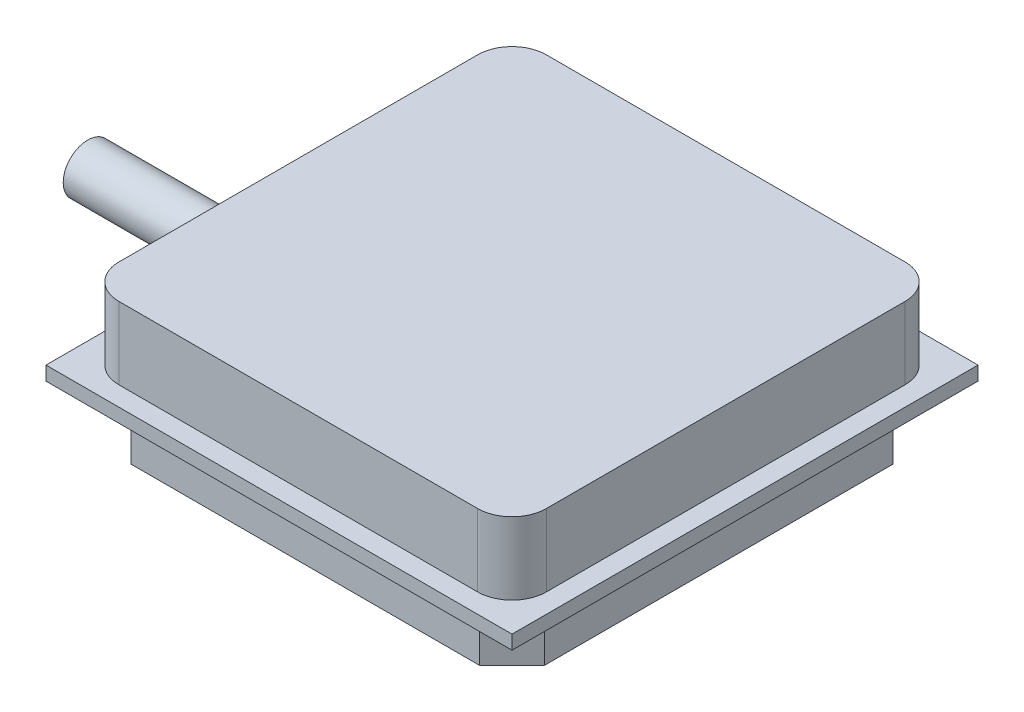
ISO-10303-21;
HEADER;
FILE_DESCRIPTION(('STEP AP214'),'2;1');
FILE_NAME('part.step','',(''),(''),'','','');
FILE_SCHEMA(('AUTOMOTIVE_DESIGN { 1 0 10303 214 1 1 1 1 }'));
ENDSEC;
DATA;
#1=APPLICATION_CONTEXT('core data for automotive mechanical design processes');
#2=APPLICATION_PROTOCOL_DEFINITION('international standard','automotive_design',2000,#1);
#3=PRODUCT_CONTEXT('',#1,'mechanical');
#4=PRODUCT('Part','Part','',(#3));
#5=PRODUCT_RELATED_PRODUCT_CATEGORY('part','',(#4));
#6=PRODUCT_DEFINITION_FORMATION('','',#4);
#7=PRODUCT_DEFINITION_CONTEXT('part definition',#1,'design');
#8=PRODUCT_DEFINITION('design','',#6,#7);
#9=PRODUCT_DEFINITION_SHAPE('','',#8);
#10=(LENGTH_UNIT() NAMED_UNIT(*) SI_UNIT(.MILLI.,.METRE.));
#11=(NAMED_UNIT(*) PLANE_ANGLE_UNIT() SI_UNIT($,.RADIAN.));
#12=(NAMED_UNIT(*) SI_UNIT($,.STERADIAN.) SOLID_ANGLE_UNIT());
#13=UNCERTAINTY_MEASURE_WITH_UNIT(LENGTH_MEASURE(1.E-05),#10,'distance_accuracy_value','');
#14=(GEOMETRIC_REPRESENTATION_CONTEXT(3) GLOBAL_UNCERTAINTY_ASSIGNED_CONTEXT((#13)) GLOBAL_UNIT_ASSIGNED_CONTEXT((#10,
#11,#12)) REPRESENTATION_CONTEXT('',''));
#15=CARTESIAN_POINT('',(0.,0.,0.));
#16=DIRECTION('',(0.,0.,1.));
#17=DIRECTION('',(1.,0.,0.));
#18=AXIS2_PLACEMENT_3D('',#15,#16,#17);
#19=CARTESIAN_POINT('',(0.,0.8128,0.));
#20=DIRECTION('',(0.,-1.,0.));
#21=DIRECTION('',(0.,0.,-1.));
#22=AXIS2_PLACEMENT_3D('',#19,#20,#21);
#23=PLANE('',#22);
#24=DIRECTION('',(0.,0.,1.));
#25=VECTOR('',#24,1.);
#26=CARTESIAN_POINT('',(0.,0.8128,0.));
#27=LINE('',#26,#25);
#28=CARTESIAN_POINT('',(0.,0.8128,-27.2034));
#29=VERTEX_POINT('',#28);
#30=CARTESIAN_POINT('',(0.,0.8128,0.));
#31=VERTEX_POINT('',#30);
#32=EDGE_CURVE('E280',#29,#31,#27,.T.);
#33=ORIENTED_EDGE('',*,*,#32,.T.);
#34=DIRECTION('',(1.,0.,0.));
#35=VECTOR('',#34,1.);
#36=CARTESIAN_POINT('',(0.,0.8128,0.));
#37=LINE('',#36,#35);
#38=CARTESIAN_POINT('',(27.2034,0.8128,0.));
#39=VERTEX_POINT('',#38);
#40=EDGE_CURVE('E283',#31,#39,#37,.T.);
#41=ORIENTED_EDGE('',*,*,#40,.T.);
#42=DIRECTION('',(0.,0.,-1.));
#43=VECTOR('',#42,1.);
#44=CARTESIAN_POINT('',(27.2034,0.8128,0.));
#45=LINE('',#44,#43);
#46=CARTESIAN_POINT('',(27.2034,0.8128,-27.2034));
#47=VERTEX_POINT('',#46);
#48=EDGE_CURVE('E286',#39,#47,#45,.T.);
#49=ORIENTED_EDGE('',*,*,#48,.T.);
#50=DIRECTION('',(-1.,0.,0.));
#51=VECTOR('',#50,1.);
#52=CARTESIAN_POINT('',(0.,0.8128,-27.2034));
#53=LINE('',#52,#51);
#54=EDGE_CURVE('E288',#47,#29,#53,.T.);
#55=ORIENTED_EDGE('',*,*,#54,.T.);
#56=EDGE_LOOP('',(#33,#41,#49,#55));
#57=FACE_BOUND('',#56,.T.);
#58=CARTESIAN_POINT('',(3.1303,0.8128,-3.1303));
#59=DIRECTION('',(0.,1.,0.));
#60=DIRECTION('',(0.,0.,1.));
#61=AXIS2_PLACEMENT_3D('',#58,#59,#60);
#62=CIRCLE('',#61,2.);
#63=CARTESIAN_POINT('',(1.1303,0.8128,-3.13030000000001));
#64=VERTEX_POINT('',#63);
#65=CARTESIAN_POINT('',(3.13030000000002,0.8128,-1.1303));
#66=VERTEX_POINT('',#65);
#67=EDGE_CURVE('E209',#64,#66,#62,.T.);
#68=ORIENTED_EDGE('',*,*,#67,.F.);
#69=DIRECTION('',(0.,0.,1.));
#70=VECTOR('',#69,1.);
#71=CARTESIAN_POINT('',(1.1303,0.8128,-24.0731));
#72=LINE('',#71,#70);
#73=CARTESIAN_POINT('',(1.1303,0.8128,-24.0731));
#74=VERTEX_POINT('',#73);
#75=EDGE_CURVE('E222',#74,#64,#72,.T.);
#76=ORIENTED_EDGE('',*,*,#75,.F.);
#77=CARTESIAN_POINT('',(3.1303,0.8128,-24.0731));
#78=DIRECTION('',(0.,1.,0.));
#79=DIRECTION('',(0.,0.,1.));
#80=AXIS2_PLACEMENT_3D('',#77,#78,#79);
#81=CIRCLE('',#80,2.);
#82=CARTESIAN_POINT('',(3.13030000000002,0.8128,-26.0731));
#83=VERTEX_POINT('',#82);
#84=EDGE_CURVE('E251',#83,#74,#81,.T.);
#85=ORIENTED_EDGE('',*,*,#84,.F.);
#86=DIRECTION('',(-1.,0.,0.));
#87=VECTOR('',#86,1.);
#88=CARTESIAN_POINT('',(3.13030000000002,0.8128,-26.0731));
#89=LINE('',#88,#87);
#90=CARTESIAN_POINT('',(24.0731,0.8128,-26.0731));
#91=VERTEX_POINT('',#90);
#92=EDGE_CURVE('E248',#91,#83,#89,.T.);
#93=ORIENTED_EDGE('',*,*,#92,.F.);
#94=CARTESIAN_POINT('',(24.0731,0.8128,-24.0731));
#95=DIRECTION('',(0.,1.,0.));
#96=DIRECTION('',(0.,0.,-1.));
#97=AXIS2_PLACEMENT_3D('',#94,#95,#96);
#98=CIRCLE('',#97,2.);
#99=CARTESIAN_POINT('',(26.0731,0.8128,-24.0731));
#100=VERTEX_POINT('',#99);
#101=EDGE_CURVE('E245',#100,#91,#98,.T.);
#102=ORIENTED_EDGE('',*,*,#101,.F.);
#103=DIRECTION('',(0.,0.,-1.));
#104=VECTOR('',#103,1.);
#105=CARTESIAN_POINT('',(26.0731,0.8128,-24.0731));
#106=LINE('',#105,#104);
#107=CARTESIAN_POINT('',(26.0731,0.8128,-3.13030000000001));
#108=VERTEX_POINT('',#107);
#109=EDGE_CURVE('E242',#108,#100,#106,.T.);
#110=ORIENTED_EDGE('',*,*,#109,.F.);
#111=CARTESIAN_POINT('',(24.0731,0.8128,-3.1303));
#112=DIRECTION('',(0.,1.,0.));
#113=DIRECTION('',(0.,0.,1.));
#114=AXIS2_PLACEMENT_3D('',#111,#112,#113);
#115=CIRCLE('',#114,2.);
#116=CARTESIAN_POINT('',(24.0731,0.8128,-1.1303));
#117=VERTEX_POINT('',#116);
#118=EDGE_CURVE('E239',#117,#108,#115,.T.);
#119=ORIENTED_EDGE('',*,*,#118,.F.);
#120=DIRECTION('',(1.,0.,0.));
#121=VECTOR('',#120,1.);
#122=CARTESIAN_POINT('',(3.13030000000002,0.8128,-1.1303));
#123=LINE('',#122,#121);
#124=EDGE_CURVE('E212',#66,#117,#123,.T.);
#125=ORIENTED_EDGE('',*,*,#124,.F.);
#126=EDGE_LOOP('',(#68,#76,#85,#93,#102,#110,#119,#125));
#127=FACE_BOUND('',#126,.T.);
#128=ADVANCED_FACE('F51',(#57,#127),#23,.F.);
#129=CARTESIAN_POINT('',(0.,0.8128,0.));
#130=DIRECTION('',(1.,0.,0.));
#131=DIRECTION('',(0.,0.,-1.));
#132=AXIS2_PLACEMENT_3D('',#129,#130,#131);
#133=PLANE('',#132);
#134=DIRECTION('',(0.,0.,1.));
#135=VECTOR('',#134,1.);
#136=CARTESIAN_POINT('',(0.,0.,0.));
#137=LINE('',#136,#135);
#138=CARTESIAN_POINT('',(0.,0.,-27.2034));
#139=VERTEX_POINT('',#138);
#140=CARTESIAN_POINT('',(0.,0.,0.));
#141=VERTEX_POINT('',#140);
#142=EDGE_CURVE('E279',#139,#141,#137,.T.);
#143=ORIENTED_EDGE('',*,*,#142,.T.);
#144=DIRECTION('',(0.,-1.,0.));
#145=VECTOR('',#144,1.);
#146=CARTESIAN_POINT('',(0.,0.8128,0.));
#147=LINE('',#146,#145);
#148=EDGE_CURVE('E59',#31,#141,#147,.T.);
#149=ORIENTED_EDGE('',*,*,#148,.F.);
#150=ORIENTED_EDGE('',*,*,#32,.F.);
#151=DIRECTION('',(0.,-1.,0.));
#152=VECTOR('',#151,1.);
#153=CARTESIAN_POINT('',(0.,0.8128,-27.2034));
#154=LINE('',#153,#152);
#155=EDGE_CURVE('E290',#29,#139,#154,.T.);
#156=ORIENTED_EDGE('',*,*,#155,.T.);
#157=EDGE_LOOP('',(#143,#149,#150,#156));
#158=FACE_BOUND('',#157,.T.);
#159=ADVANCED_FACE('F53',(#158),#133,.F.);
#160=CARTESIAN_POINT('',(0.,0.8128,0.));
#161=DIRECTION('',(0.,0.,-1.));
#162=DIRECTION('',(-1.,0.,0.));
#163=AXIS2_PLACEMENT_3D('',#160,#161,#162);
#164=PLANE('',#163);
#165=DIRECTION('',(1.,0.,0.));
#166=VECTOR('',#165,1.);
#167=CARTESIAN_POINT('',(0.,0.,0.));
#168=LINE('',#167,#166);
#169=CARTESIAN_POINT('',(27.2034,0.,0.));
#170=VERTEX_POINT('',#169);
#171=EDGE_CURVE('E293',#141,#170,#168,.T.);
#172=ORIENTED_EDGE('',*,*,#171,.T.);
#173=DIRECTION('',(0.,-1.,0.));
#174=VECTOR('',#173,1.);
#175=CARTESIAN_POINT('',(27.2034,0.8128,0.));
#176=LINE('',#175,#174);
#177=EDGE_CURVE('E303',#39,#170,#176,.T.);
#178=ORIENTED_EDGE('',*,*,#177,.F.);
#179=ORIENTED_EDGE('',*,*,#40,.F.);
#180=ORIENTED_EDGE('',*,*,#148,.T.);
#181=EDGE_LOOP('',(#172,#178,#179,#180));
#182=FACE_BOUND('',#181,.T.);
#183=ADVANCED_FACE('F308',(#182),#164,.F.);
#184=CARTESIAN_POINT('',(27.2034,0.8128,0.));
#185=DIRECTION('',(-1.,0.,0.));
#186=DIRECTION('',(0.,0.,1.));
#187=AXIS2_PLACEMENT_3D('',#184,#185,#186);
#188=PLANE('',#187);
#189=DIRECTION('',(0.,0.,-1.));
#190=VECTOR('',#189,1.);
#191=CARTESIAN_POINT('',(27.2034,0.,0.));
#192=LINE('',#191,#190);
#193=CARTESIAN_POINT('',(27.2034,0.,-27.2034));
#194=VERTEX_POINT('',#193);
#195=EDGE_CURVE('E295',#170,#194,#192,.T.);
#196=ORIENTED_EDGE('',*,*,#195,.T.);
#197=DIRECTION('',(0.,-1.,0.));
#198=VECTOR('',#197,1.);
#199=CARTESIAN_POINT('',(27.2034,0.8128,-27.2034));
#200=LINE('',#199,#198);
#201=EDGE_CURVE('E300',#47,#194,#200,.T.);
#202=ORIENTED_EDGE('',*,*,#201,.F.);
#203=ORIENTED_EDGE('',*,*,#48,.F.);
#204=ORIENTED_EDGE('',*,*,#177,.T.);
#205=EDGE_LOOP('',(#196,#202,#203,#204));
#206=FACE_BOUND('',#205,.T.);
#207=ADVANCED_FACE('F320',(#206),#188,.F.);
#208=CARTESIAN_POINT('',(0.,0.8128,-27.2034));
#209=DIRECTION('',(0.,0.,1.));
#210=DIRECTION('',(1.,0.,0.));
#211=AXIS2_PLACEMENT_3D('',#208,#209,#210);
#212=PLANE('',#211);
#213=DIRECTION('',(-1.,0.,0.));
#214=VECTOR('',#213,1.);
#215=CARTESIAN_POINT('',(0.,0.,-27.2034));
#216=LINE('',#215,#214);
#217=EDGE_CURVE('E284',#194,#139,#216,.T.);
#218=ORIENTED_EDGE('',*,*,#217,.T.);
#219=ORIENTED_EDGE('',*,*,#155,.F.);
#220=ORIENTED_EDGE('',*,*,#54,.F.);
#221=ORIENTED_EDGE('',*,*,#201,.T.);
#222=EDGE_LOOP('',(#218,#219,#220,#221));
#223=FACE_BOUND('',#222,.T.);
#224=ADVANCED_FACE('F324',(#223),#212,.F.);
#225=CARTESIAN_POINT('',(0.,0.,0.));
#226=DIRECTION('',(0.,-1.,0.));
#227=DIRECTION('',(0.,0.,-1.));
#228=AXIS2_PLACEMENT_3D('',#225,#226,#227);
#229=PLANE('',#228);
#230=DIRECTION('',(1.,0.,0.));
#231=VECTOR('',#230,1.);
#232=CARTESIAN_POINT('',(0.,0.,-25.6667));
#233=LINE('',#232,#231);
#234=CARTESIAN_POINT('',(3.43158584423278,0.,-25.6667));
#235=VERTEX_POINT('',#234);
#236=CARTESIAN_POINT('',(23.7718141557672,0.,-25.6667));
#237=VERTEX_POINT('',#236);
#238=EDGE_CURVE('E66',#235,#237,#233,.T.);
#239=ORIENTED_EDGE('',*,*,#238,.F.);
#240=DIRECTION('',(0.707106781186551,0.,-0.707106781186544));
#241=VECTOR('',#240,1.);
#242=CARTESIAN_POINT('',(-11.1175570778836,0.,-11.1175570778837));
#243=LINE('',#242,#241);
#244=CARTESIAN_POINT('',(1.5367,0.,-23.7718141557672));
#245=VERTEX_POINT('',#244);
#246=EDGE_CURVE('E70',#245,#235,#243,.T.);
#247=ORIENTED_EDGE('',*,*,#246,.F.);
#248=DIRECTION('',(0.,0.,-1.));
#249=VECTOR('',#248,1.);
#250=CARTESIAN_POINT('',(1.5367,0.,0.));
#251=LINE('',#250,#249);
#252=CARTESIAN_POINT('',(1.5367,0.,-3.43158584423279));
#253=VERTEX_POINT('',#252);
#254=EDGE_CURVE('E746',#253,#245,#251,.T.);
#255=ORIENTED_EDGE('',*,*,#254,.F.);
#256=DIRECTION('',(0.707106781186544,0.,0.707106781186551));
#257=VECTOR('',#256,1.);
#258=CARTESIAN_POINT('',(2.4841429221164,0.,-2.48414292211637));
#259=LINE('',#258,#257);
#260=CARTESIAN_POINT('',(3.43158584423277,0.,-1.5367));
#261=VERTEX_POINT('',#260);
#262=EDGE_CURVE('E752',#253,#261,#259,.T.);
#263=ORIENTED_EDGE('',*,*,#262,.T.);
#264=DIRECTION('',(1.,0.,0.));
#265=VECTOR('',#264,1.);
#266=CARTESIAN_POINT('',(0.,0.,-1.5367));
#267=LINE('',#266,#265);
#268=CARTESIAN_POINT('',(23.7718141557672,0.,-1.5367));
#269=VERTEX_POINT('',#268);
#270=EDGE_CURVE('E775',#261,#269,#267,.T.);
#271=ORIENTED_EDGE('',*,*,#270,.T.);
#272=DIRECTION('',(0.707106781186551,0.,-0.707106781186544));
#273=VECTOR('',#272,1.);
#274=CARTESIAN_POINT('',(11.1175570778835,0.,11.1175570778836));
#275=LINE('',#274,#273);
#276=CARTESIAN_POINT('',(25.6667,0.,-3.43158584423277));
#277=VERTEX_POINT('',#276);
#278=EDGE_CURVE('E769',#269,#277,#275,.T.);
#279=ORIENTED_EDGE('',*,*,#278,.T.);
#280=DIRECTION('',(0.,0.,-1.));
#281=VECTOR('',#280,1.);
#282=CARTESIAN_POINT('',(25.6667,0.,0.));
#283=LINE('',#282,#281);
#284=CARTESIAN_POINT('',(25.6667,0.,-23.7718141557672));
#285=VERTEX_POINT('',#284);
#286=EDGE_CURVE('E772',#277,#285,#283,.T.);
#287=ORIENTED_EDGE('',*,*,#286,.T.);
#288=DIRECTION('',(0.707106781186544,0.,0.707106781186552));
#289=VECTOR('',#288,1.);
#290=CARTESIAN_POINT('',(24.7192570778837,0.,-24.7192570778835));
#291=LINE('',#290,#289);
#292=EDGE_CURVE('E773',#237,#285,#291,.T.);
#293=ORIENTED_EDGE('',*,*,#292,.F.);
#294=EDGE_LOOP('',(#239,#247,#255,#263,#271,#279,#287,#293));
#295=FACE_BOUND('',#294,.T.);
#296=ORIENTED_EDGE('',*,*,#142,.F.);
#297=ORIENTED_EDGE('',*,*,#217,.F.);
#298=ORIENTED_EDGE('',*,*,#195,.F.);
#299=ORIENTED_EDGE('',*,*,#171,.F.);
#300=EDGE_LOOP('',(#296,#297,#298,#299));
#301=FACE_BOUND('',#300,.T.);
#302=ADVANCED_FACE('F316',(#295,#301),#229,.T.);
#303=CARTESIAN_POINT('',(3.1303,5.0292,-3.1303));
#304=DIRECTION('',(0.,-1.,0.));
#305=DIRECTION('',(0.,0.,-1.));
#306=AXIS2_PLACEMENT_3D('',#303,#304,#305);
#307=CYLINDRICAL_SURFACE('',#306,2.);
#308=ORIENTED_EDGE('',*,*,#67,.T.);
#309=DIRECTION('',(0.,-1.,0.));
#310=VECTOR('',#309,1.);
#311=CARTESIAN_POINT('',(3.13030000000002,5.0292,-1.1303));
#312=LINE('',#311,#310);
#313=CARTESIAN_POINT('',(3.13030000000002,5.0292,-1.1303));
#314=VERTEX_POINT('',#313);
#315=EDGE_CURVE('E276',#314,#66,#312,.T.);
#316=ORIENTED_EDGE('',*,*,#315,.F.);
#317=CARTESIAN_POINT('',(3.1303,5.0292,-3.1303));
#318=DIRECTION('',(0.,1.,0.));
#319=DIRECTION('',(0.,0.,1.));
#320=AXIS2_PLACEMENT_3D('',#317,#318,#319);
#321=CIRCLE('',#320,2.);
#322=CARTESIAN_POINT('',(1.1303,5.0292,-3.13030000000001));
#323=VERTEX_POINT('',#322);
#324=EDGE_CURVE('E218',#323,#314,#321,.T.);
#325=ORIENTED_EDGE('',*,*,#324,.F.);
#326=DIRECTION('',(0.,-1.,0.));
#327=VECTOR('',#326,1.);
#328=CARTESIAN_POINT('',(1.1303,5.0292,-3.13030000000001));
#329=LINE('',#328,#327);
#330=EDGE_CURVE('E235',#323,#64,#329,.T.);
#331=ORIENTED_EDGE('',*,*,#330,.T.);
#332=EDGE_LOOP('',(#308,#316,#325,#331));
#333=FACE_BOUND('',#332,.T.);
#334=ADVANCED_FACE('F337',(#333),#307,.T.);
#335=CARTESIAN_POINT('',(3.13030000000002,5.0292,-1.1303));
#336=DIRECTION('',(0.,0.,-1.));
#337=DIRECTION('',(-1.,0.,0.));
#338=AXIS2_PLACEMENT_3D('',#335,#336,#337);
#339=PLANE('',#338);
#340=ORIENTED_EDGE('',*,*,#124,.T.);
#341=DIRECTION('',(0.,-1.,0.));
#342=VECTOR('',#341,1.);
#343=CARTESIAN_POINT('',(24.0731,5.0292,-1.1303));
#344=LINE('',#343,#342);
#345=CARTESIAN_POINT('',(24.0731,5.0292,-1.1303));
#346=VERTEX_POINT('',#345);
#347=EDGE_CURVE('E273',#346,#117,#344,.T.);
#348=ORIENTED_EDGE('',*,*,#347,.F.);
#349=DIRECTION('',(1.,0.,0.));
#350=VECTOR('',#349,1.);
#351=CARTESIAN_POINT('',(3.13030000000002,5.0292,-1.1303));
#352=LINE('',#351,#350);
#353=EDGE_CURVE('E221',#314,#346,#352,.T.);
#354=ORIENTED_EDGE('',*,*,#353,.F.);
#355=ORIENTED_EDGE('',*,*,#315,.T.);
#356=EDGE_LOOP('',(#340,#348,#354,#355));
#357=FACE_BOUND('',#356,.T.);
#358=ADVANCED_FACE('F361',(#357),#339,.F.);
#359=CARTESIAN_POINT('',(24.0731,5.0292,-3.1303));
#360=DIRECTION('',(0.,-1.,0.));
#361=DIRECTION('',(0.,0.,-1.));
#362=AXIS2_PLACEMENT_3D('',#359,#360,#361);
#363=CYLINDRICAL_SURFACE('',#362,2.);
#364=ORIENTED_EDGE('',*,*,#118,.T.);
#365=DIRECTION('',(0.,-1.,0.));
#366=VECTOR('',#365,1.);
#367=CARTESIAN_POINT('',(26.0731,5.0292,-3.13030000000001));
#368=LINE('',#367,#366);
#369=CARTESIAN_POINT('',(26.0731,5.0292,-3.13030000000001));
#370=VERTEX_POINT('',#369);
#371=EDGE_CURVE('E270',#370,#108,#368,.T.);
#372=ORIENTED_EDGE('',*,*,#371,.F.);
#373=CARTESIAN_POINT('',(24.0731,5.0292,-3.1303));
#374=DIRECTION('',(0.,1.,0.));
#375=DIRECTION('',(0.,0.,1.));
#376=AXIS2_PLACEMENT_3D('',#373,#374,#375);
#377=CIRCLE('',#376,2.);
#378=EDGE_CURVE('E224',#346,#370,#377,.T.);
#379=ORIENTED_EDGE('',*,*,#378,.F.);
#380=ORIENTED_EDGE('',*,*,#347,.T.);
#381=EDGE_LOOP('',(#364,#372,#379,#380));
#382=FACE_BOUND('',#381,.T.);
#383=ADVANCED_FACE('F359',(#382),#363,.T.);
#384=CARTESIAN_POINT('',(26.0731,5.0292,-24.0731));
#385=DIRECTION('',(-1.,0.,0.));
#386=DIRECTION('',(0.,0.,1.));
#387=AXIS2_PLACEMENT_3D('',#384,#385,#386);
#388=PLANE('',#387);
#389=ORIENTED_EDGE('',*,*,#109,.T.);
#390=DIRECTION('',(0.,-1.,0.));
#391=VECTOR('',#390,1.);
#392=CARTESIAN_POINT('',(26.0731,5.0292,-24.0731));
#393=LINE('',#392,#391);
#394=CARTESIAN_POINT('',(26.0731,5.0292,-24.0731));
#395=VERTEX_POINT('',#394);
#396=EDGE_CURVE('E267',#395,#100,#393,.T.);
#397=ORIENTED_EDGE('',*,*,#396,.F.);
#398=DIRECTION('',(0.,0.,-1.));
#399=VECTOR('',#398,1.);
#400=CARTESIAN_POINT('',(26.0731,5.0292,-24.0731));
#401=LINE('',#400,#399);
#402=EDGE_CURVE('E226',#370,#395,#401,.T.);
#403=ORIENTED_EDGE('',*,*,#402,.F.);
#404=ORIENTED_EDGE('',*,*,#371,.T.);
#405=EDGE_LOOP('',(#389,#397,#403,#404));
#406=FACE_BOUND('',#405,.T.);
#407=ADVANCED_FACE('F354',(#406),#388,.F.);
#408=CARTESIAN_POINT('',(24.0731,5.0292,-24.0731));
#409=DIRECTION('',(0.,-1.,0.));
#410=DIRECTION('',(0.,0.,-1.));
#411=AXIS2_PLACEMENT_3D('',#408,#409,#410);
#412=CYLINDRICAL_SURFACE('',#411,2.);
#413=ORIENTED_EDGE('',*,*,#101,.T.);
#414=DIRECTION('',(0.,-1.,0.));
#415=VECTOR('',#414,1.);
#416=CARTESIAN_POINT('',(24.0731,5.0292,-26.0731));
#417=LINE('',#416,#415);
#418=CARTESIAN_POINT('',(24.0731,5.0292,-26.0731));
#419=VERTEX_POINT('',#418);
#420=EDGE_CURVE('E264',#419,#91,#417,.T.);
#421=ORIENTED_EDGE('',*,*,#420,.F.);
#422=CARTESIAN_POINT('',(24.0731,5.0292,-24.0731));
#423=DIRECTION('',(0.,1.,0.));
#424=DIRECTION('',(0.,0.,-1.));
#425=AXIS2_PLACEMENT_3D('',#422,#423,#424);
#426=CIRCLE('',#425,2.);
#427=EDGE_CURVE('E228',#395,#419,#426,.T.);
#428=ORIENTED_EDGE('',*,*,#427,.F.);
#429=ORIENTED_EDGE('',*,*,#396,.T.);
#430=EDGE_LOOP('',(#413,#421,#428,#429));
#431=FACE_BOUND('',#430,.T.);
#432=ADVANCED_FACE('F351',(#431),#412,.T.);
#433=CARTESIAN_POINT('',(3.13030000000002,5.0292,-26.0731));
#434=DIRECTION('',(0.,0.,1.));
#435=DIRECTION('',(1.,0.,0.));
#436=AXIS2_PLACEMENT_3D('',#433,#434,#435);
#437=PLANE('',#436);
#438=ORIENTED_EDGE('',*,*,#92,.T.);
#439=DIRECTION('',(0.,-1.,0.));
#440=VECTOR('',#439,1.);
#441=CARTESIAN_POINT('',(3.13030000000002,5.0292,-26.0731));
#442=LINE('',#441,#440);
#443=CARTESIAN_POINT('',(3.13030000000002,5.0292,-26.0731));
#444=VERTEX_POINT('',#443);
#445=EDGE_CURVE('E261',#444,#83,#442,.T.);
#446=ORIENTED_EDGE('',*,*,#445,.F.);
#447=DIRECTION('',(-1.,0.,0.));
#448=VECTOR('',#447,1.);
#449=CARTESIAN_POINT('',(3.13030000000002,5.0292,-26.0731));
#450=LINE('',#449,#448);
#451=EDGE_CURVE('E230',#419,#444,#450,.T.);
#452=ORIENTED_EDGE('',*,*,#451,.F.);
#453=ORIENTED_EDGE('',*,*,#420,.T.);
#454=EDGE_LOOP('',(#438,#446,#452,#453));
#455=FACE_BOUND('',#454,.T.);
#456=ADVANCED_FACE('F347',(#455),#437,.F.);
#457=CARTESIAN_POINT('',(3.1303,5.0292,-24.0731));
#458=DIRECTION('',(0.,-1.,0.));
#459=DIRECTION('',(0.,0.,-1.));
#460=AXIS2_PLACEMENT_3D('',#457,#458,#459);
#461=CYLINDRICAL_SURFACE('',#460,2.);
#462=ORIENTED_EDGE('',*,*,#84,.T.);
#463=DIRECTION('',(0.,-1.,0.));
#464=VECTOR('',#463,1.);
#465=CARTESIAN_POINT('',(1.1303,5.0292,-24.0731));
#466=LINE('',#465,#464);
#467=CARTESIAN_POINT('',(1.1303,5.0292,-24.0731));
#468=VERTEX_POINT('',#467);
#469=EDGE_CURVE('E258',#468,#74,#466,.T.);
#470=ORIENTED_EDGE('',*,*,#469,.F.);
#471=CARTESIAN_POINT('',(3.1303,5.0292,-24.0731));
#472=DIRECTION('',(0.,1.,0.));
#473=DIRECTION('',(0.,0.,1.));
#474=AXIS2_PLACEMENT_3D('',#471,#472,#473);
#475=CIRCLE('',#474,2.);
#476=EDGE_CURVE('E232',#444,#468,#475,.T.);
#477=ORIENTED_EDGE('',*,*,#476,.F.);
#478=ORIENTED_EDGE('',*,*,#445,.T.);
#479=EDGE_LOOP('',(#462,#470,#477,#478));
#480=FACE_BOUND('',#479,.T.);
#481=ADVANCED_FACE('F345',(#480),#461,.T.);
#482=CARTESIAN_POINT('',(1.1303,5.0292,-24.0731));
#483=DIRECTION('',(1.,0.,0.));
#484=DIRECTION('',(0.,0.,-1.));
#485=AXIS2_PLACEMENT_3D('',#482,#483,#484);
#486=PLANE('',#485);
#487=ORIENTED_EDGE('',*,*,#75,.T.);
#488=ORIENTED_EDGE('',*,*,#330,.F.);
#489=DIRECTION('',(0.,0.,1.));
#490=VECTOR('',#489,1.);
#491=CARTESIAN_POINT('',(1.1303,5.0292,-24.0731));
#492=LINE('',#491,#490);
#493=EDGE_CURVE('E234',#468,#323,#492,.T.);
#494=ORIENTED_EDGE('',*,*,#493,.F.);
#495=ORIENTED_EDGE('',*,*,#469,.T.);
#496=EDGE_LOOP('',(#487,#488,#494,#495));
#497=FACE_BOUND('',#496,.T.);
#498=ADVANCED_FACE('F333',(#497),#486,.F.);
#499=CARTESIAN_POINT('',(3.1303,5.0292,-3.1303));
#500=DIRECTION('',(0.,1.,0.));
#501=DIRECTION('',(0.,0.,1.));
#502=AXIS2_PLACEMENT_3D('',#499,#500,#501);
#503=PLANE('',#502);
#504=ORIENTED_EDGE('',*,*,#324,.T.);
#505=ORIENTED_EDGE('',*,*,#353,.T.);
#506=ORIENTED_EDGE('',*,*,#378,.T.);
#507=ORIENTED_EDGE('',*,*,#402,.T.);
#508=ORIENTED_EDGE('',*,*,#427,.T.);
#509=ORIENTED_EDGE('',*,*,#451,.T.);
#510=ORIENTED_EDGE('',*,*,#476,.T.);
#511=ORIENTED_EDGE('',*,*,#493,.T.);
#512=EDGE_LOOP('',(#504,#505,#506,#507,#508,#509,#510,#511));
#513=FACE_BOUND('',#512,.T.);
#514=ADVANCED_FACE('F339',(#513),#503,.T.);
#515=CARTESIAN_POINT('',(0.,-3.2512,-25.6667));
#516=DIRECTION('',(0.,0.,1.));
#517=DIRECTION('',(1.,0.,0.));
#518=AXIS2_PLACEMENT_3D('',#515,#516,#517);
#519=PLANE('',#518);
#520=ORIENTED_EDGE('',*,*,#238,.T.);
#521=DIRECTION('',(0.,1.,0.));
#522=VECTOR('',#521,1.);
#523=CARTESIAN_POINT('',(23.7718141557672,-3.2512,-25.6667));
#524=LINE('',#523,#522);
#525=CARTESIAN_POINT('',(23.7718141557672,-3.2512,-25.6667));
#526=VERTEX_POINT('',#525);
#527=EDGE_CURVE('E191',#526,#237,#524,.T.);
#528=ORIENTED_EDGE('',*,*,#527,.F.);
#529=DIRECTION('',(1.,0.,0.));
#530=VECTOR('',#529,1.);
#531=CARTESIAN_POINT('',(0.,-3.2512,-25.6667));
#532=LINE('',#531,#530);
#533=CARTESIAN_POINT('',(3.43158584423278,-3.2512,-25.6667));
#534=VERTEX_POINT('',#533);
#535=EDGE_CURVE('E198',#534,#526,#532,.T.);
#536=ORIENTED_EDGE('',*,*,#535,.F.);
#537=DIRECTION('',(0.,1.,0.));
#538=VECTOR('',#537,1.);
#539=CARTESIAN_POINT('',(3.43158584423278,-3.2512,-25.6667));
#540=LINE('',#539,#538);
#541=EDGE_CURVE('E754',#534,#235,#540,.T.);
#542=ORIENTED_EDGE('',*,*,#541,.T.);
#543=EDGE_LOOP('',(#520,#528,#536,#542));
#544=FACE_BOUND('',#543,.T.);
#545=ADVANCED_FACE('F208',(#544),#519,.F.);
#546=CARTESIAN_POINT('',(24.7192570778837,-3.2512,-24.7192570778835));
#547=DIRECTION('',(-0.707106781186552,0.,0.707106781186544));
#548=DIRECTION('',(0.707106781186544,0.,0.707106781186552));
#549=AXIS2_PLACEMENT_3D('',#546,#547,#548);
#550=PLANE('',#549);
#551=ORIENTED_EDGE('',*,*,#292,.T.);
#552=DIRECTION('',(0.,1.,0.));
#553=VECTOR('',#552,1.);
#554=CARTESIAN_POINT('',(25.6667,-3.2512,-23.7718141557672));
#555=LINE('',#554,#553);
#556=CARTESIAN_POINT('',(25.6667,-3.2512,-23.7718141557672));
#557=VERTEX_POINT('',#556);
#558=EDGE_CURVE('E193',#557,#285,#555,.T.);
#559=ORIENTED_EDGE('',*,*,#558,.F.);
#560=DIRECTION('',(0.707106781186544,0.,0.707106781186552));
#561=VECTOR('',#560,1.);
#562=CARTESIAN_POINT('',(24.7192570778837,-3.2512,-24.7192570778835));
#563=LINE('',#562,#561);
#564=EDGE_CURVE('E186',#526,#557,#563,.T.);
#565=ORIENTED_EDGE('',*,*,#564,.F.);
#566=ORIENTED_EDGE('',*,*,#527,.T.);
#567=EDGE_LOOP('',(#551,#559,#565,#566));
#568=FACE_BOUND('',#567,.T.);
#569=ADVANCED_FACE('F189',(#568),#550,.F.);
#570=CARTESIAN_POINT('',(25.6667,-3.2512,0.));
#571=DIRECTION('',(1.,0.,0.));
#572=DIRECTION('',(0.,0.,-1.));
#573=AXIS2_PLACEMENT_3D('',#570,#571,#572);
#574=PLANE('',#573);
#575=ORIENTED_EDGE('',*,*,#286,.F.);
#576=DIRECTION('',(0.,1.,0.));
#577=VECTOR('',#576,1.);
#578=CARTESIAN_POINT('',(25.6667,-3.2512,-3.43158584423277));
#579=LINE('',#578,#577);
#580=CARTESIAN_POINT('',(25.6667,-3.2512,-3.43158584423277));
#581=VERTEX_POINT('',#580);
#582=EDGE_CURVE('E214',#581,#277,#579,.T.);
#583=ORIENTED_EDGE('',*,*,#582,.F.);
#584=DIRECTION('',(0.,0.,-1.));
#585=VECTOR('',#584,1.);
#586=CARTESIAN_POINT('',(25.6667,-3.2512,0.));
#587=LINE('',#586,#585);
#588=EDGE_CURVE('E197',#581,#557,#587,.T.);
#589=ORIENTED_EDGE('',*,*,#588,.T.);
#590=ORIENTED_EDGE('',*,*,#558,.T.);
#591=EDGE_LOOP('',(#575,#583,#589,#590));
#592=FACE_BOUND('',#591,.T.);
#593=ADVANCED_FACE('F434',(#592),#574,.T.);
#594=CARTESIAN_POINT('',(11.1175570778835,-3.2512,11.1175570778836));
#595=DIRECTION('',(0.707106781186544,0.,0.707106781186551));
#596=DIRECTION('',(0.707106781186551,0.,-0.707106781186544));
#597=AXIS2_PLACEMENT_3D('',#594,#595,#596);
#598=PLANE('',#597);
#599=ORIENTED_EDGE('',*,*,#278,.F.);
#600=DIRECTION('',(0.,1.,0.));
#601=VECTOR('',#600,1.);
#602=CARTESIAN_POINT('',(23.7718141557672,-3.2512,-1.5367));
#603=LINE('',#602,#601);
#604=CARTESIAN_POINT('',(23.7718141557672,-3.2512,-1.5367));
#605=VERTEX_POINT('',#604);
#606=EDGE_CURVE('E763',#605,#269,#603,.T.);
#607=ORIENTED_EDGE('',*,*,#606,.F.);
#608=DIRECTION('',(0.707106781186551,0.,-0.707106781186544));
#609=VECTOR('',#608,1.);
#610=CARTESIAN_POINT('',(11.1175570778835,-3.2512,11.1175570778836));
#611=LINE('',#610,#609);
#612=EDGE_CURVE('E771',#605,#581,#611,.T.);
#613=ORIENTED_EDGE('',*,*,#612,.T.);
#614=ORIENTED_EDGE('',*,*,#582,.T.);
#615=EDGE_LOOP('',(#599,#607,#613,#614));
#616=FACE_BOUND('',#615,.T.);
#617=ADVANCED_FACE('F427',(#616),#598,.T.);
#618=CARTESIAN_POINT('',(0.,-3.2512,-1.5367));
#619=DIRECTION('',(0.,0.,1.));
#620=DIRECTION('',(1.,0.,0.));
#621=AXIS2_PLACEMENT_3D('',#618,#619,#620);
#622=PLANE('',#621);
#623=ORIENTED_EDGE('',*,*,#270,.F.);
#624=DIRECTION('',(0.,1.,0.));
#625=VECTOR('',#624,1.);
#626=CARTESIAN_POINT('',(3.43158584423277,-3.2512,-1.5367));
#627=LINE('',#626,#625);
#628=CARTESIAN_POINT('',(3.43158584423277,-3.2512,-1.5367));
#629=VERTEX_POINT('',#628);
#630=EDGE_CURVE('E756',#629,#261,#627,.T.);
#631=ORIENTED_EDGE('',*,*,#630,.F.);
#632=DIRECTION('',(1.,0.,0.));
#633=VECTOR('',#632,1.);
#634=CARTESIAN_POINT('',(0.,-3.2512,-1.5367));
#635=LINE('',#634,#633);
#636=EDGE_CURVE('E787',#629,#605,#635,.T.);
#637=ORIENTED_EDGE('',*,*,#636,.T.);
#638=ORIENTED_EDGE('',*,*,#606,.T.);
#639=EDGE_LOOP('',(#623,#631,#637,#638));
#640=FACE_BOUND('',#639,.T.);
#641=ADVANCED_FACE('F433',(#640),#622,.T.);
#642=CARTESIAN_POINT('',(2.4841429221164,-3.2512,-2.48414292211637));
#643=DIRECTION('',(-0.707106781186551,0.,0.707106781186544));
#644=DIRECTION('',(0.707106781186544,0.,0.707106781186551));
#645=AXIS2_PLACEMENT_3D('',#642,#643,#644);
#646=PLANE('',#645);
#647=ORIENTED_EDGE('',*,*,#262,.F.);
#648=DIRECTION('',(0.,1.,0.));
#649=VECTOR('',#648,1.);
#650=CARTESIAN_POINT('',(1.5367,-3.2512,-3.43158584423279));
#651=LINE('',#650,#649);
#652=CARTESIAN_POINT('',(1.5367,-3.2512,-3.43158584423279));
#653=VERTEX_POINT('',#652);
#654=EDGE_CURVE('E750',#653,#253,#651,.T.);
#655=ORIENTED_EDGE('',*,*,#654,.F.);
#656=DIRECTION('',(0.707106781186544,0.,0.707106781186551));
#657=VECTOR('',#656,1.);
#658=CARTESIAN_POINT('',(2.4841429221164,-3.2512,-2.48414292211637));
#659=LINE('',#658,#657);
#660=EDGE_CURVE('E784',#653,#629,#659,.T.);
#661=ORIENTED_EDGE('',*,*,#660,.T.);
#662=ORIENTED_EDGE('',*,*,#630,.T.);
#663=EDGE_LOOP('',(#647,#655,#661,#662));
#664=FACE_BOUND('',#663,.T.);
#665=ADVANCED_FACE('F447',(#664),#646,.T.);
#666=CARTESIAN_POINT('',(1.5367,-3.2512,0.));
#667=DIRECTION('',(1.,0.,0.));
#668=DIRECTION('',(0.,0.,-1.));
#669=AXIS2_PLACEMENT_3D('',#666,#667,#668);
#670=PLANE('',#669);
#671=CARTESIAN_POINT('',(1.5367,-1.6256,-13.6017));
#672=DIRECTION('',(1.,0.,0.));
#673=DIRECTION('',(0.,0.,-1.));
#674=AXIS2_PLACEMENT_3D('',#671,#672,#673);
#675=CIRCLE('',#674,1.4351);
#676=CARTESIAN_POINT('',(1.5367,-1.6256,-15.0368));
#677=VERTEX_POINT('',#676);
#678=EDGE_CURVE('E11',#677,#677,#675,.F.);
#679=ORIENTED_EDGE('',*,*,#678,.F.);
#680=EDGE_LOOP('',(#679));
#681=FACE_BOUND('',#680,.T.);
#682=ORIENTED_EDGE('',*,*,#254,.T.);
#683=DIRECTION('',(0.,1.,0.));
#684=VECTOR('',#683,1.);
#685=CARTESIAN_POINT('',(1.5367,-3.2512,-23.7718141557672));
#686=LINE('',#685,#684);
#687=CARTESIAN_POINT('',(1.5367,-3.2512,-23.7718141557672));
#688=VERTEX_POINT('',#687);
#689=EDGE_CURVE('E749',#688,#245,#686,.T.);
#690=ORIENTED_EDGE('',*,*,#689,.F.);
#691=DIRECTION('',(0.,0.,-1.));
#692=VECTOR('',#691,1.);
#693=CARTESIAN_POINT('',(1.5367,-3.2512,0.));
#694=LINE('',#693,#692);
#695=EDGE_CURVE('E793',#653,#688,#694,.T.);
#696=ORIENTED_EDGE('',*,*,#695,.F.);
#697=ORIENTED_EDGE('',*,*,#654,.T.);
#698=EDGE_LOOP('',(#682,#690,#696,#697));
#699=FACE_BOUND('',#698,.T.);
#700=ADVANCED_FACE('F417',(#681,#699),#670,.F.);
#701=CARTESIAN_POINT('',(-11.1175570778836,-3.2512,-11.1175570778837));
#702=DIRECTION('',(0.707106781186544,0.,0.707106781186551));
#703=DIRECTION('',(0.707106781186551,0.,-0.707106781186544));
#704=AXIS2_PLACEMENT_3D('',#701,#702,#703);
#705=PLANE('',#704);
#706=ORIENTED_EDGE('',*,*,#246,.T.);
#707=ORIENTED_EDGE('',*,*,#541,.F.);
#708=DIRECTION('',(0.707106781186551,0.,-0.707106781186544));
#709=VECTOR('',#708,1.);
#710=CARTESIAN_POINT('',(-11.1175570778836,-3.2512,-11.1175570778837));
#711=LINE('',#710,#709);
#712=EDGE_CURVE('E203',#688,#534,#711,.T.);
#713=ORIENTED_EDGE('',*,*,#712,.F.);
#714=ORIENTED_EDGE('',*,*,#689,.T.);
#715=EDGE_LOOP('',(#706,#707,#713,#714));
#716=FACE_BOUND('',#715,.T.);
#717=ADVANCED_FACE('F411',(#716),#705,.F.);
#718=CARTESIAN_POINT('',(0.,-3.2512,0.));
#719=DIRECTION('',(0.,-1.,0.));
#720=DIRECTION('',(0.,0.,-1.));
#721=AXIS2_PLACEMENT_3D('',#718,#719,#720);
#722=PLANE('',#721);
#723=ORIENTED_EDGE('',*,*,#535,.T.);
#724=ORIENTED_EDGE('',*,*,#564,.T.);
#725=ORIENTED_EDGE('',*,*,#588,.F.);
#726=ORIENTED_EDGE('',*,*,#612,.F.);
#727=ORIENTED_EDGE('',*,*,#636,.F.);
#728=ORIENTED_EDGE('',*,*,#660,.F.);
#729=ORIENTED_EDGE('',*,*,#695,.T.);
#730=ORIENTED_EDGE('',*,*,#712,.T.);
#731=EDGE_LOOP('',(#723,#724,#725,#726,#727,#728,#729,#730));
#732=FACE_BOUND('',#731,.T.);
#733=ADVANCED_FACE('F201',(#732),#722,.T.);
#734=CARTESIAN_POINT('',(-11.1633,-1.6256,-13.6017));
#735=DIRECTION('',(1.,0.,0.));
#736=DIRECTION('',(0.,0.,-1.));
#737=AXIS2_PLACEMENT_3D('',#734,#735,#736);
#738=CYLINDRICAL_SURFACE('',#737,1.4351);
#739=CARTESIAN_POINT('',(-11.1633,-1.6256,-13.6017));
#740=DIRECTION('',(-1.,0.,0.));
#741=DIRECTION('',(0.,0.,1.));
#742=AXIS2_PLACEMENT_3D('',#739,#740,#741);
#743=CIRCLE('',#742,1.4351);
#744=CARTESIAN_POINT('',(-11.1633,-1.6256,-12.1666));
#745=VERTEX_POINT('',#744);
#746=EDGE_CURVE('E741',#745,#745,#743,.T.);
#747=ORIENTED_EDGE('',*,*,#746,.F.);
#748=EDGE_LOOP('',(#747));
#749=FACE_BOUND('',#748,.T.);
#750=ORIENTED_EDGE('',*,*,#678,.T.);
#751=EDGE_LOOP('',(#750));
#752=FACE_BOUND('',#751,.T.);
#753=ADVANCED_FACE('F475',(#749,#752),#738,.T.);
#754=CARTESIAN_POINT('',(-11.1633,-1.6256,-13.6017));
#755=DIRECTION('',(-1.,0.,0.));
#756=DIRECTION('',(0.,0.,1.));
#757=AXIS2_PLACEMENT_3D('',#754,#755,#756);
#758=PLANE('',#757);
#759=ORIENTED_EDGE('',*,*,#746,.T.);
#760=EDGE_LOOP('',(#759));
#761=FACE_BOUND('',#760,.T.);
#762=ADVANCED_FACE('F509',(#761),#758,.T.);
#763=CLOSED_SHELL('',(#128,#159,#183,#207,#224,#302,#334,#358,#383,#407,#432,#456,#481,#498,
#514,#545,#569,#593,#617,#641,#665,#700,#717,#733,#753,#762));
#764=MANIFOLD_SOLID_BREP('B2',#763);
#765=ADVANCED_BREP_SHAPE_REPRESENTATION('',(#18,#764),#14);
#766=SHAPE_DEFINITION_REPRESENTATION(#9,#765);
ENDSEC;
END-ISO-10303-21;
